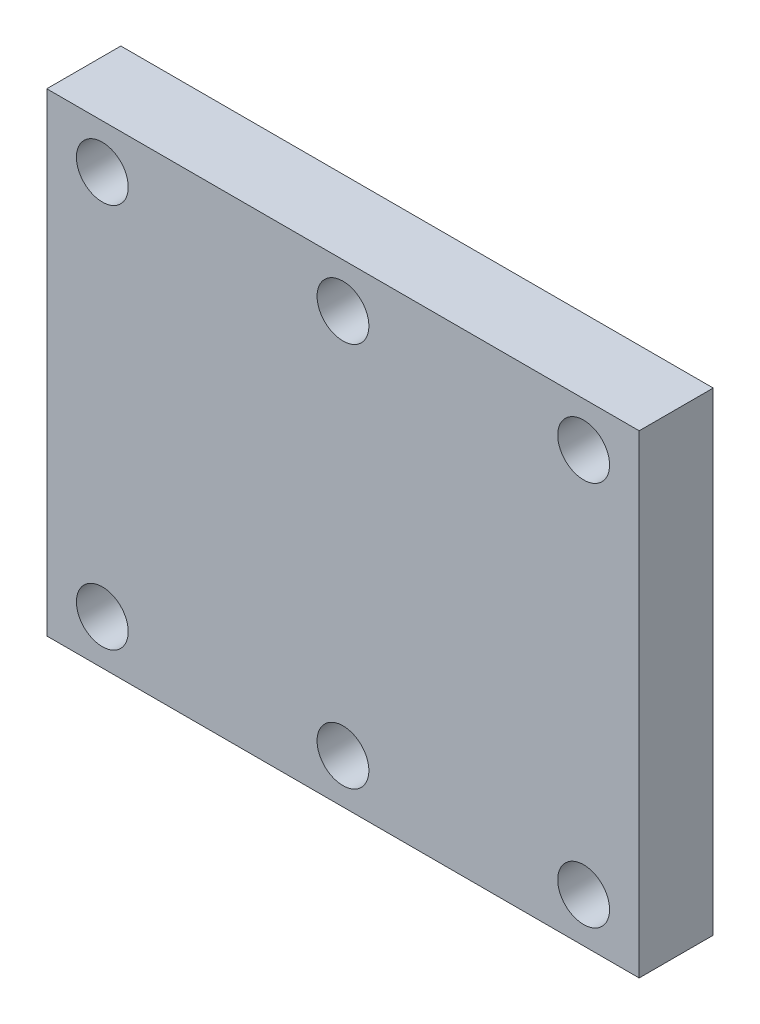
ISO-10303-21;
HEADER;
FILE_DESCRIPTION(('STEP AP214'),'2;1');
FILE_NAME('part.step','',(''),(''),'','','');
FILE_SCHEMA(('AUTOMOTIVE_DESIGN { 1 0 10303 214 1 1 1 1 }'));
ENDSEC;
DATA;
#1=APPLICATION_CONTEXT('core data for automotive mechanical design processes');
#2=APPLICATION_PROTOCOL_DEFINITION('international standard','automotive_design',2000,#1);
#3=PRODUCT_CONTEXT('',#1,'mechanical');
#4=PRODUCT('Part','Part','',(#3));
#5=PRODUCT_RELATED_PRODUCT_CATEGORY('part','',(#4));
#6=PRODUCT_DEFINITION_FORMATION('','',#4);
#7=PRODUCT_DEFINITION_CONTEXT('part definition',#1,'design');
#8=PRODUCT_DEFINITION('design','',#6,#7);
#9=PRODUCT_DEFINITION_SHAPE('','',#8);
#10=(LENGTH_UNIT() NAMED_UNIT(*) SI_UNIT(.MILLI.,.METRE.));
#11=(NAMED_UNIT(*) PLANE_ANGLE_UNIT() SI_UNIT($,.RADIAN.));
#12=(NAMED_UNIT(*) SI_UNIT($,.STERADIAN.) SOLID_ANGLE_UNIT());
#13=UNCERTAINTY_MEASURE_WITH_UNIT(LENGTH_MEASURE(1.E-05),#10,'distance_accuracy_value','');
#14=(GEOMETRIC_REPRESENTATION_CONTEXT(3) GLOBAL_UNCERTAINTY_ASSIGNED_CONTEXT((#13)) GLOBAL_UNIT_ASSIGNED_CONTEXT((#10,
#11,#12)) REPRESENTATION_CONTEXT('',''));
#15=CARTESIAN_POINT('',(0.,0.,0.));
#16=DIRECTION('',(0.,0.,1.));
#17=DIRECTION('',(1.,0.,0.));
#18=AXIS2_PLACEMENT_3D('',#15,#16,#17);
#19=CARTESIAN_POINT('',(72.5,26.,10.));
#20=DIRECTION('',(0.,0.,1.));
#21=DIRECTION('',(1.,0.,0.));
#22=AXIS2_PLACEMENT_3D('',#19,#20,#21);
#23=CYLINDRICAL_SURFACE('',#22,3.5);
#24=CARTESIAN_POINT('',(72.5,26.,10.));
#25=DIRECTION('',(0.,0.,1.));
#26=DIRECTION('',(1.,0.,0.));
#27=AXIS2_PLACEMENT_3D('',#24,#25,#26);
#28=CIRCLE('',#27,3.5);
#29=CARTESIAN_POINT('',(76.,26.,10.));
#30=VERTEX_POINT('',#29);
#31=EDGE_CURVE('E44',#30,#30,#28,.T.);
#32=ORIENTED_EDGE('',*,*,#31,.T.);
#33=EDGE_LOOP('',(#32));
#34=FACE_BOUND('',#33,.T.);
#35=CARTESIAN_POINT('',(72.5,26.,0.));
#36=DIRECTION('',(0.,0.,1.));
#37=DIRECTION('',(1.,0.,0.));
#38=AXIS2_PLACEMENT_3D('',#35,#36,#37);
#39=CIRCLE('',#38,3.5);
#40=CARTESIAN_POINT('',(76.,26.,0.));
#41=VERTEX_POINT('',#40);
#42=EDGE_CURVE('E11',#41,#41,#39,.T.);
#43=ORIENTED_EDGE('',*,*,#42,.F.);
#44=EDGE_LOOP('',(#43));
#45=FACE_BOUND('',#44,.T.);
#46=ADVANCED_FACE('F36',(#34,#45),#23,.F.);
#47=CARTESIAN_POINT('',(40.,26.,10.));
#48=DIRECTION('',(0.,0.,1.));
#49=DIRECTION('',(1.,0.,0.));
#50=AXIS2_PLACEMENT_3D('',#47,#48,#49);
#51=CYLINDRICAL_SURFACE('',#50,3.5);
#52=CARTESIAN_POINT('',(40.,26.,10.));
#53=DIRECTION('',(0.,0.,1.));
#54=DIRECTION('',(1.,0.,0.));
#55=AXIS2_PLACEMENT_3D('',#52,#53,#54);
#56=CIRCLE('',#55,3.5);
#57=CARTESIAN_POINT('',(43.5,26.,10.));
#58=VERTEX_POINT('',#57);
#59=EDGE_CURVE('E126',#58,#58,#56,.T.);
#60=ORIENTED_EDGE('',*,*,#59,.T.);
#61=EDGE_LOOP('',(#60));
#62=FACE_BOUND('',#61,.T.);
#63=CARTESIAN_POINT('',(40.,26.,0.));
#64=DIRECTION('',(0.,0.,1.));
#65=DIRECTION('',(1.,0.,0.));
#66=AXIS2_PLACEMENT_3D('',#63,#64,#65);
#67=CIRCLE('',#66,3.5);
#68=CARTESIAN_POINT('',(43.5,26.,0.));
#69=VERTEX_POINT('',#68);
#70=EDGE_CURVE('E129',#69,#69,#67,.T.);
#71=ORIENTED_EDGE('',*,*,#70,.F.);
#72=EDGE_LOOP('',(#71));
#73=FACE_BOUND('',#72,.T.);
#74=ADVANCED_FACE('F153',(#62,#73),#51,.F.);
#75=CARTESIAN_POINT('',(7.50000000000001,26.,10.));
#76=DIRECTION('',(0.,0.,1.));
#77=DIRECTION('',(1.,0.,0.));
#78=AXIS2_PLACEMENT_3D('',#75,#76,#77);
#79=CYLINDRICAL_SURFACE('',#78,3.5);
#80=CARTESIAN_POINT('',(7.50000000000001,26.,10.));
#81=DIRECTION('',(0.,0.,1.));
#82=DIRECTION('',(1.,0.,0.));
#83=AXIS2_PLACEMENT_3D('',#80,#81,#82);
#84=CIRCLE('',#83,3.5);
#85=CARTESIAN_POINT('',(11.,26.,10.));
#86=VERTEX_POINT('',#85);
#87=EDGE_CURVE('E120',#86,#86,#84,.T.);
#88=ORIENTED_EDGE('',*,*,#87,.T.);
#89=EDGE_LOOP('',(#88));
#90=FACE_BOUND('',#89,.T.);
#91=CARTESIAN_POINT('',(7.50000000000001,26.,0.));
#92=DIRECTION('',(0.,0.,1.));
#93=DIRECTION('',(1.,0.,0.));
#94=AXIS2_PLACEMENT_3D('',#91,#92,#93);
#95=CIRCLE('',#94,3.5);
#96=CARTESIAN_POINT('',(11.,26.,0.));
#97=VERTEX_POINT('',#96);
#98=EDGE_CURVE('E123',#97,#97,#95,.T.);
#99=ORIENTED_EDGE('',*,*,#98,.F.);
#100=EDGE_LOOP('',(#99));
#101=FACE_BOUND('',#100,.T.);
#102=ADVANCED_FACE('F157',(#90,#101),#79,.F.);
#103=CARTESIAN_POINT('',(72.5,-26.,10.));
#104=DIRECTION('',(0.,0.,1.));
#105=DIRECTION('',(1.,0.,0.));
#106=AXIS2_PLACEMENT_3D('',#103,#104,#105);
#107=CYLINDRICAL_SURFACE('',#106,3.5);
#108=CARTESIAN_POINT('',(72.5,-26.,10.));
#109=DIRECTION('',(0.,0.,1.));
#110=DIRECTION('',(1.,0.,0.));
#111=AXIS2_PLACEMENT_3D('',#108,#109,#110);
#112=CIRCLE('',#111,3.5);
#113=CARTESIAN_POINT('',(76.,-26.,10.));
#114=VERTEX_POINT('',#113);
#115=EDGE_CURVE('E114',#114,#114,#112,.T.);
#116=ORIENTED_EDGE('',*,*,#115,.T.);
#117=EDGE_LOOP('',(#116));
#118=FACE_BOUND('',#117,.T.);
#119=CARTESIAN_POINT('',(72.5,-26.,0.));
#120=DIRECTION('',(0.,0.,1.));
#121=DIRECTION('',(1.,0.,0.));
#122=AXIS2_PLACEMENT_3D('',#119,#120,#121);
#123=CIRCLE('',#122,3.5);
#124=CARTESIAN_POINT('',(76.,-26.,0.));
#125=VERTEX_POINT('',#124);
#126=EDGE_CURVE('E117',#125,#125,#123,.T.);
#127=ORIENTED_EDGE('',*,*,#126,.F.);
#128=EDGE_LOOP('',(#127));
#129=FACE_BOUND('',#128,.T.);
#130=ADVANCED_FACE('F162',(#118,#129),#107,.F.);
#131=CARTESIAN_POINT('',(0.,32.,10.));
#132=DIRECTION('',(1.,0.,0.));
#133=DIRECTION('',(0.,0.,-1.));
#134=AXIS2_PLACEMENT_3D('',#131,#132,#133);
#135=PLANE('',#134);
#136=DIRECTION('',(0.,-1.,0.));
#137=VECTOR('',#136,1.);
#138=CARTESIAN_POINT('',(0.,32.,0.));
#139=LINE('',#138,#137);
#140=CARTESIAN_POINT('',(0.,32.,0.));
#141=VERTEX_POINT('',#140);
#142=CARTESIAN_POINT('',(0.,-32.,0.));
#143=VERTEX_POINT('',#142);
#144=EDGE_CURVE('E104',#141,#143,#139,.T.);
#145=ORIENTED_EDGE('',*,*,#144,.T.);
#146=DIRECTION('',(0.,0.,-1.));
#147=VECTOR('',#146,1.);
#148=CARTESIAN_POINT('',(0.,-32.,10.));
#149=LINE('',#148,#147);
#150=CARTESIAN_POINT('',(0.,-32.,10.));
#151=VERTEX_POINT('',#150);
#152=EDGE_CURVE('E95',#151,#143,#149,.T.);
#153=ORIENTED_EDGE('',*,*,#152,.F.);
#154=DIRECTION('',(0.,-1.,0.));
#155=VECTOR('',#154,1.);
#156=CARTESIAN_POINT('',(0.,32.,10.));
#157=LINE('',#156,#155);
#158=CARTESIAN_POINT('',(0.,32.,10.));
#159=VERTEX_POINT('',#158);
#160=EDGE_CURVE('E89',#159,#151,#157,.T.);
#161=ORIENTED_EDGE('',*,*,#160,.F.);
#162=DIRECTION('',(0.,0.,-1.));
#163=VECTOR('',#162,1.);
#164=CARTESIAN_POINT('',(0.,32.,10.));
#165=LINE('',#164,#163);
#166=EDGE_CURVE('E100',#159,#141,#165,.T.);
#167=ORIENTED_EDGE('',*,*,#166,.T.);
#168=EDGE_LOOP('',(#145,#153,#161,#167));
#169=FACE_BOUND('',#168,.T.);
#170=ADVANCED_FACE('F169',(#169),#135,.F.);
#171=CARTESIAN_POINT('',(0.,-32.,10.));
#172=DIRECTION('',(0.,1.,0.));
#173=DIRECTION('',(0.,0.,1.));
#174=AXIS2_PLACEMENT_3D('',#171,#172,#173);
#175=PLANE('',#174);
#176=DIRECTION('',(1.,0.,0.));
#177=VECTOR('',#176,1.);
#178=CARTESIAN_POINT('',(0.,-32.,0.));
#179=LINE('',#178,#177);
#180=CARTESIAN_POINT('',(80.,-32.,0.));
#181=VERTEX_POINT('',#180);
#182=EDGE_CURVE('E94',#143,#181,#179,.T.);
#183=ORIENTED_EDGE('',*,*,#182,.T.);
#184=DIRECTION('',(0.,0.,-1.));
#185=VECTOR('',#184,1.);
#186=CARTESIAN_POINT('',(80.,-32.,10.));
#187=LINE('',#186,#185);
#188=CARTESIAN_POINT('',(80.,-32.,10.));
#189=VERTEX_POINT('',#188);
#190=EDGE_CURVE('E92',#189,#181,#187,.T.);
#191=ORIENTED_EDGE('',*,*,#190,.F.);
#192=DIRECTION('',(1.,0.,0.));
#193=VECTOR('',#192,1.);
#194=CARTESIAN_POINT('',(0.,-32.,10.));
#195=LINE('',#194,#193);
#196=EDGE_CURVE('E83',#151,#189,#195,.T.);
#197=ORIENTED_EDGE('',*,*,#196,.F.);
#198=ORIENTED_EDGE('',*,*,#152,.T.);
#199=EDGE_LOOP('',(#183,#191,#197,#198));
#200=FACE_BOUND('',#199,.T.);
#201=ADVANCED_FACE('F93',(#200),#175,.F.);
#202=CARTESIAN_POINT('',(80.,32.,10.));
#203=DIRECTION('',(-1.,0.,0.));
#204=DIRECTION('',(0.,0.,1.));
#205=AXIS2_PLACEMENT_3D('',#202,#203,#204);
#206=PLANE('',#205);
#207=DIRECTION('',(0.,1.,0.));
#208=VECTOR('',#207,1.);
#209=CARTESIAN_POINT('',(80.,32.,0.));
#210=LINE('',#209,#208);
#211=CARTESIAN_POINT('',(80.,32.,0.));
#212=VERTEX_POINT('',#211);
#213=EDGE_CURVE('E69',#181,#212,#210,.T.);
#214=ORIENTED_EDGE('',*,*,#213,.T.);
#215=DIRECTION('',(0.,0.,-1.));
#216=VECTOR('',#215,1.);
#217=CARTESIAN_POINT('',(80.,32.,10.));
#218=LINE('',#217,#216);
#219=CARTESIAN_POINT('',(80.,32.,10.));
#220=VERTEX_POINT('',#219);
#221=EDGE_CURVE('E96',#220,#212,#218,.T.);
#222=ORIENTED_EDGE('',*,*,#221,.F.);
#223=DIRECTION('',(0.,1.,0.));
#224=VECTOR('',#223,1.);
#225=CARTESIAN_POINT('',(80.,32.,10.));
#226=LINE('',#225,#224);
#227=EDGE_CURVE('E87',#189,#220,#226,.T.);
#228=ORIENTED_EDGE('',*,*,#227,.F.);
#229=ORIENTED_EDGE('',*,*,#190,.T.);
#230=EDGE_LOOP('',(#214,#222,#228,#229));
#231=FACE_BOUND('',#230,.T.);
#232=ADVANCED_FACE('F98',(#231),#206,.F.);
#233=CARTESIAN_POINT('',(0.,32.,10.));
#234=DIRECTION('',(0.,-1.,0.));
#235=DIRECTION('',(0.,0.,-1.));
#236=AXIS2_PLACEMENT_3D('',#233,#234,#235);
#237=PLANE('',#236);
#238=DIRECTION('',(-1.,0.,0.));
#239=VECTOR('',#238,1.);
#240=CARTESIAN_POINT('',(0.,32.,0.));
#241=LINE('',#240,#239);
#242=EDGE_CURVE('E75',#212,#141,#241,.T.);
#243=ORIENTED_EDGE('',*,*,#242,.T.);
#244=ORIENTED_EDGE('',*,*,#166,.F.);
#245=DIRECTION('',(-1.,0.,0.));
#246=VECTOR('',#245,1.);
#247=CARTESIAN_POINT('',(0.,32.,10.));
#248=LINE('',#247,#246);
#249=EDGE_CURVE('E52',#220,#159,#248,.T.);
#250=ORIENTED_EDGE('',*,*,#249,.F.);
#251=ORIENTED_EDGE('',*,*,#221,.T.);
#252=EDGE_LOOP('',(#243,#244,#250,#251));
#253=FACE_BOUND('',#252,.T.);
#254=ADVANCED_FACE('F138',(#253),#237,.F.);
#255=CARTESIAN_POINT('',(0.,0.,10.));
#256=DIRECTION('',(0.,0.,1.));
#257=DIRECTION('',(1.,0.,0.));
#258=AXIS2_PLACEMENT_3D('',#255,#256,#257);
#259=PLANE('',#258);
#260=CARTESIAN_POINT('',(40.,-26.,10.));
#261=DIRECTION('',(0.,0.,1.));
#262=DIRECTION('',(1.,0.,0.));
#263=AXIS2_PLACEMENT_3D('',#260,#261,#262);
#264=CIRCLE('',#263,3.5);
#265=CARTESIAN_POINT('',(43.5,-26.,10.));
#266=VERTEX_POINT('',#265);
#267=EDGE_CURVE('E239',#266,#266,#264,.T.);
#268=ORIENTED_EDGE('',*,*,#267,.F.);
#269=EDGE_LOOP('',(#268));
#270=FACE_BOUND('',#269,.T.);
#271=CARTESIAN_POINT('',(7.50000000000001,-26.,10.));
#272=DIRECTION('',(0.,0.,1.));
#273=DIRECTION('',(1.,0.,0.));
#274=AXIS2_PLACEMENT_3D('',#271,#272,#273);
#275=CIRCLE('',#274,3.5);
#276=CARTESIAN_POINT('',(11.,-26.,10.));
#277=VERTEX_POINT('',#276);
#278=EDGE_CURVE('E243',#277,#277,#275,.T.);
#279=ORIENTED_EDGE('',*,*,#278,.F.);
#280=EDGE_LOOP('',(#279));
#281=FACE_BOUND('',#280,.T.);
#282=ORIENTED_EDGE('',*,*,#160,.T.);
#283=ORIENTED_EDGE('',*,*,#196,.T.);
#284=ORIENTED_EDGE('',*,*,#227,.T.);
#285=ORIENTED_EDGE('',*,*,#249,.T.);
#286=EDGE_LOOP('',(#282,#283,#284,#285));
#287=FACE_BOUND('',#286,.T.);
#288=ORIENTED_EDGE('',*,*,#115,.F.);
#289=EDGE_LOOP('',(#288));
#290=FACE_BOUND('',#289,.T.);
#291=ORIENTED_EDGE('',*,*,#87,.F.);
#292=EDGE_LOOP('',(#291));
#293=FACE_BOUND('',#292,.T.);
#294=ORIENTED_EDGE('',*,*,#59,.F.);
#295=EDGE_LOOP('',(#294));
#296=FACE_BOUND('',#295,.T.);
#297=ORIENTED_EDGE('',*,*,#31,.F.);
#298=EDGE_LOOP('',(#297));
#299=FACE_BOUND('',#298,.T.);
#300=ADVANCED_FACE('F84',(#270,#281,#287,#290,#293,#296,#299),#259,.T.);
#301=CARTESIAN_POINT('',(0.,0.,0.));
#302=DIRECTION('',(0.,0.,1.));
#303=DIRECTION('',(1.,0.,0.));
#304=AXIS2_PLACEMENT_3D('',#301,#302,#303);
#305=PLANE('',#304);
#306=CARTESIAN_POINT('',(40.,-26.,0.));
#307=DIRECTION('',(0.,0.,1.));
#308=DIRECTION('',(1.,0.,0.));
#309=AXIS2_PLACEMENT_3D('',#306,#307,#308);
#310=CIRCLE('',#309,3.5);
#311=CARTESIAN_POINT('',(43.5,-26.,0.));
#312=VERTEX_POINT('',#311);
#313=EDGE_CURVE('E242',#312,#312,#310,.T.);
#314=ORIENTED_EDGE('',*,*,#313,.T.);
#315=EDGE_LOOP('',(#314));
#316=FACE_BOUND('',#315,.T.);
#317=CARTESIAN_POINT('',(7.50000000000001,-26.,0.));
#318=DIRECTION('',(0.,0.,1.));
#319=DIRECTION('',(1.,0.,0.));
#320=AXIS2_PLACEMENT_3D('',#317,#318,#319);
#321=CIRCLE('',#320,3.5);
#322=CARTESIAN_POINT('',(11.,-26.,0.));
#323=VERTEX_POINT('',#322);
#324=EDGE_CURVE('E107',#323,#323,#321,.T.);
#325=ORIENTED_EDGE('',*,*,#324,.T.);
#326=EDGE_LOOP('',(#325));
#327=FACE_BOUND('',#326,.T.);
#328=ORIENTED_EDGE('',*,*,#144,.F.);
#329=ORIENTED_EDGE('',*,*,#242,.F.);
#330=ORIENTED_EDGE('',*,*,#213,.F.);
#331=ORIENTED_EDGE('',*,*,#182,.F.);
#332=EDGE_LOOP('',(#328,#329,#330,#331));
#333=FACE_BOUND('',#332,.T.);
#334=ORIENTED_EDGE('',*,*,#126,.T.);
#335=EDGE_LOOP('',(#334));
#336=FACE_BOUND('',#335,.T.);
#337=ORIENTED_EDGE('',*,*,#98,.T.);
#338=EDGE_LOOP('',(#337));
#339=FACE_BOUND('',#338,.T.);
#340=ORIENTED_EDGE('',*,*,#70,.T.);
#341=EDGE_LOOP('',(#340));
#342=FACE_BOUND('',#341,.T.);
#343=ORIENTED_EDGE('',*,*,#42,.T.);
#344=EDGE_LOOP('',(#343));
#345=FACE_BOUND('',#344,.T.);
#346=ADVANCED_FACE('F137',(#316,#327,#333,#336,#339,#342,#345),#305,.F.);
#347=CARTESIAN_POINT('',(7.50000000000001,-26.,10.));
#348=DIRECTION('',(0.,0.,1.));
#349=DIRECTION('',(1.,0.,0.));
#350=AXIS2_PLACEMENT_3D('',#347,#348,#349);
#351=CYLINDRICAL_SURFACE('',#350,3.5);
#352=ORIENTED_EDGE('',*,*,#278,.T.);
#353=EDGE_LOOP('',(#352));
#354=FACE_BOUND('',#353,.T.);
#355=ORIENTED_EDGE('',*,*,#324,.F.);
#356=EDGE_LOOP('',(#355));
#357=FACE_BOUND('',#356,.T.);
#358=ADVANCED_FACE('F145',(#354,#357),#351,.F.);
#359=CARTESIAN_POINT('',(40.,-26.,10.));
#360=DIRECTION('',(0.,0.,1.));
#361=DIRECTION('',(1.,0.,0.));
#362=AXIS2_PLACEMENT_3D('',#359,#360,#361);
#363=CYLINDRICAL_SURFACE('',#362,3.5);
#364=ORIENTED_EDGE('',*,*,#267,.T.);
#365=EDGE_LOOP('',(#364));
#366=FACE_BOUND('',#365,.T.);
#367=ORIENTED_EDGE('',*,*,#313,.F.);
#368=EDGE_LOOP('',(#367));
#369=FACE_BOUND('',#368,.T.);
#370=ADVANCED_FACE('F194',(#366,#369),#363,.F.);
#371=CLOSED_SHELL('',(#46,#74,#102,#130,#170,#201,#232,#254,#300,#346,#358,#370));
#372=MANIFOLD_SOLID_BREP('B2',#371);
#373=ADVANCED_BREP_SHAPE_REPRESENTATION('',(#18,#372),#14);
#374=SHAPE_DEFINITION_REPRESENTATION(#9,#373);
ENDSEC;
END-ISO-10303-21;
